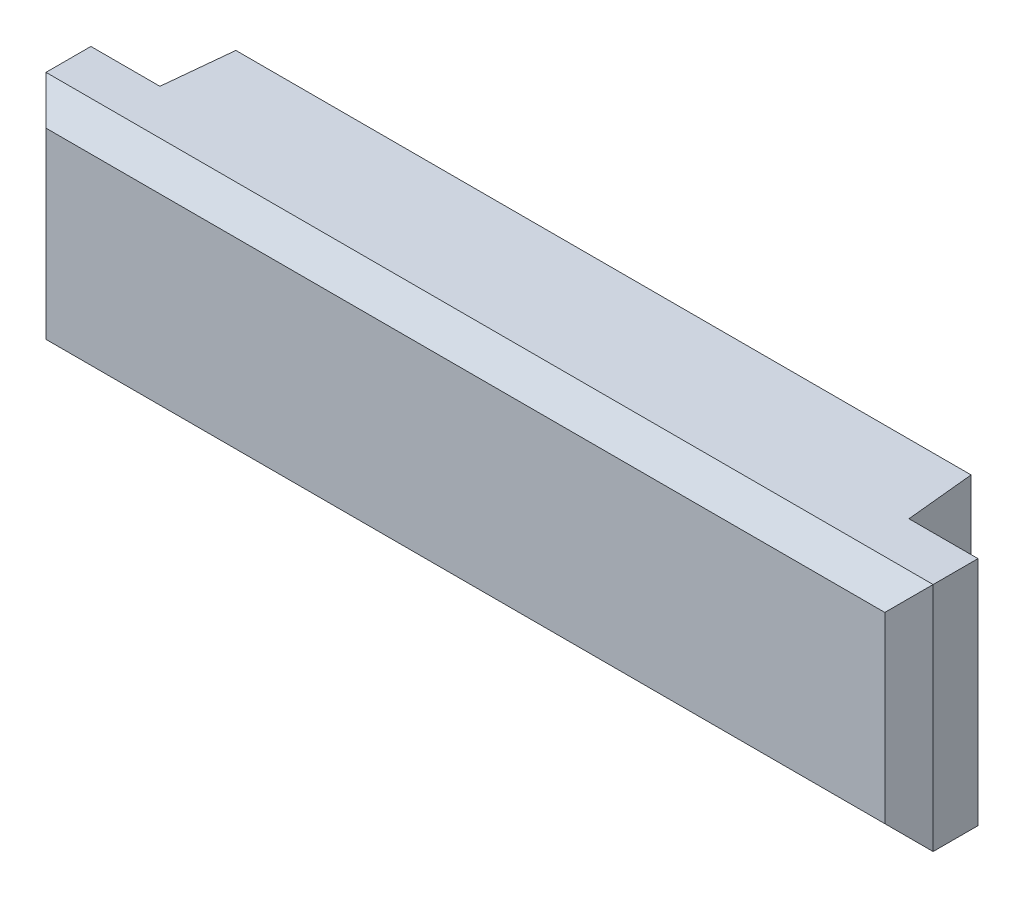
ISO-10303-21;
HEADER;
FILE_DESCRIPTION(('STEP AP214'),'2;1');
FILE_NAME('part.step','',(''),(''),'','','');
FILE_SCHEMA(('AUTOMOTIVE_DESIGN { 1 0 10303 214 1 1 1 1 }'));
ENDSEC;
DATA;
#1=APPLICATION_CONTEXT('core data for automotive mechanical design processes');
#2=APPLICATION_PROTOCOL_DEFINITION('international standard','automotive_design',2000,#1);
#3=PRODUCT_CONTEXT('',#1,'mechanical');
#4=PRODUCT('Part','Part','',(#3));
#5=PRODUCT_RELATED_PRODUCT_CATEGORY('part','',(#4));
#6=PRODUCT_DEFINITION_FORMATION('','',#4);
#7=PRODUCT_DEFINITION_CONTEXT('part definition',#1,'design');
#8=PRODUCT_DEFINITION('design','',#6,#7);
#9=PRODUCT_DEFINITION_SHAPE('','',#8);
#10=(LENGTH_UNIT() NAMED_UNIT(*) SI_UNIT(.MILLI.,.METRE.));
#11=(NAMED_UNIT(*) PLANE_ANGLE_UNIT() SI_UNIT($,.RADIAN.));
#12=(NAMED_UNIT(*) SI_UNIT($,.STERADIAN.) SOLID_ANGLE_UNIT());
#13=UNCERTAINTY_MEASURE_WITH_UNIT(LENGTH_MEASURE(1.E-05),#10,'distance_accuracy_value','');
#14=(GEOMETRIC_REPRESENTATION_CONTEXT(3) GLOBAL_UNCERTAINTY_ASSIGNED_CONTEXT((#13)) GLOBAL_UNIT_ASSIGNED_CONTEXT((#10,
#11,#12)) REPRESENTATION_CONTEXT('',''));
#15=CARTESIAN_POINT('',(0.,0.,0.));
#16=DIRECTION('',(0.,0.,1.));
#17=DIRECTION('',(1.,0.,0.));
#18=AXIS2_PLACEMENT_3D('',#15,#16,#17);
#19=CARTESIAN_POINT('',(0.,0.,0.));
#20=DIRECTION('',(0.,0.,1.));
#21=DIRECTION('',(1.,0.,0.));
#22=AXIS2_PLACEMENT_3D('',#19,#20,#21);
#23=PLANE('',#22);
#24=DIRECTION('',(0.,-1.,0.));
#25=VECTOR('',#24,1.);
#26=CARTESIAN_POINT('',(-10.65,-2.35,0.));
#27=LINE('',#26,#25);
#28=CARTESIAN_POINT('',(-10.65,2.35,0.));
#29=VERTEX_POINT('',#28);
#30=CARTESIAN_POINT('',(-10.65,-2.35,0.));
#31=VERTEX_POINT('',#30);
#32=EDGE_CURVE('E280',#29,#31,#27,.T.);
#33=ORIENTED_EDGE('',*,*,#32,.F.);
#34=DIRECTION('',(-1.,0.,0.));
#35=VECTOR('',#34,1.);
#36=CARTESIAN_POINT('',(10.65,2.35,0.));
#37=LINE('',#36,#35);
#38=CARTESIAN_POINT('',(10.65,2.35,0.));
#39=VERTEX_POINT('',#38);
#40=EDGE_CURVE('E272',#39,#29,#37,.T.);
#41=ORIENTED_EDGE('',*,*,#40,.F.);
#42=DIRECTION('',(0.,1.,0.));
#43=VECTOR('',#42,1.);
#44=CARTESIAN_POINT('',(10.65,-2.35,0.));
#45=LINE('',#44,#43);
#46=CARTESIAN_POINT('',(10.65,-2.35,0.));
#47=VERTEX_POINT('',#46);
#48=EDGE_CURVE('E279',#47,#39,#45,.T.);
#49=ORIENTED_EDGE('',*,*,#48,.F.);
#50=DIRECTION('',(1.,0.,0.));
#51=VECTOR('',#50,1.);
#52=CARTESIAN_POINT('',(10.65,-2.35,0.));
#53=LINE('',#52,#51);
#54=EDGE_CURVE('E196',#31,#47,#53,.T.);
#55=ORIENTED_EDGE('',*,*,#54,.F.);
#56=EDGE_LOOP('',(#33,#41,#49,#55));
#57=FACE_BOUND('',#56,.T.);
#58=ADVANCED_FACE('F53',(#57),#23,.F.);
#59=CARTESIAN_POINT('',(0.,2.35,0.));
#60=DIRECTION('',(0.,1.,0.));
#61=DIRECTION('',(0.,0.,1.));
#62=AXIS2_PLACEMENT_3D('',#59,#60,#61);
#63=PLANE('',#62);
#64=DIRECTION('',(0.,0.,-1.));
#65=VECTOR('',#64,1.);
#66=CARTESIAN_POINT('',(-12.85,2.35,4.));
#67=LINE('',#66,#65);
#68=CARTESIAN_POINT('',(-12.85,2.35,3.3));
#69=VERTEX_POINT('',#68);
#70=CARTESIAN_POINT('',(-12.85,2.35,2.));
#71=VERTEX_POINT('',#70);
#72=EDGE_CURVE('E153',#69,#71,#67,.T.);
#73=ORIENTED_EDGE('',*,*,#72,.F.);
#74=DIRECTION('',(1.,0.,0.));
#75=VECTOR('',#74,1.);
#76=CARTESIAN_POINT('',(0.,2.34999999999999,3.3));
#77=LINE('',#76,#75);
#78=CARTESIAN_POINT('',(12.85,2.35,3.3));
#79=VERTEX_POINT('',#78);
#80=EDGE_CURVE('E177',#69,#79,#77,.T.);
#81=ORIENTED_EDGE('',*,*,#80,.T.);
#82=DIRECTION('',(0.,0.,-1.));
#83=VECTOR('',#82,1.);
#84=CARTESIAN_POINT('',(12.85,2.35,4.));
#85=LINE('',#84,#83);
#86=CARTESIAN_POINT('',(12.85,2.35,2.));
#87=VERTEX_POINT('',#86);
#88=EDGE_CURVE('E171',#79,#87,#85,.T.);
#89=ORIENTED_EDGE('',*,*,#88,.T.);
#90=DIRECTION('',(-1.,0.,0.));
#91=VECTOR('',#90,1.);
#92=CARTESIAN_POINT('',(-12.85,2.35,2.));
#93=LINE('',#92,#91);
#94=CARTESIAN_POINT('',(10.85,2.35,2.));
#95=VERTEX_POINT('',#94);
#96=EDGE_CURVE('E168',#87,#95,#93,.T.);
#97=ORIENTED_EDGE('',*,*,#96,.T.);
#98=DIRECTION('',(-0.0995037190209992,0.,-0.995037190209989));
#99=VECTOR('',#98,1.);
#100=CARTESIAN_POINT('',(10.85,2.35,2.));
#101=LINE('',#100,#99);
#102=EDGE_CURVE('E310',#95,#39,#101,.T.);
#103=ORIENTED_EDGE('',*,*,#102,.T.);
#104=ORIENTED_EDGE('',*,*,#40,.T.);
#105=DIRECTION('',(0.0995037190209992,0.,-0.995037190209989));
#106=VECTOR('',#105,1.);
#107=CARTESIAN_POINT('',(-10.85,2.35,2.));
#108=LINE('',#107,#106);
#109=CARTESIAN_POINT('',(-10.85,2.35,2.));
#110=VERTEX_POINT('',#109);
#111=EDGE_CURVE('E299',#110,#29,#108,.T.);
#112=ORIENTED_EDGE('',*,*,#111,.F.);
#113=EDGE_CURVE('E160',#110,#71,#93,.T.);
#114=ORIENTED_EDGE('',*,*,#113,.T.);
#115=EDGE_LOOP('',(#73,#81,#89,#97,#103,#104,#112,#114));
#116=FACE_BOUND('',#115,.T.);
#117=ADVANCED_FACE('F174',(#116),#63,.T.);
#118=CARTESIAN_POINT('',(-10.5445544554455,0.,-1.05445544554456));
#119=DIRECTION('',(-0.995037190209989,0.,-0.0995037190209992));
#120=DIRECTION('',(-0.0995037190209992,0.,0.995037190209989));
#121=AXIS2_PLACEMENT_3D('',#118,#119,#120);
#122=PLANE('',#121);
#123=ORIENTED_EDGE('',*,*,#111,.T.);
#124=ORIENTED_EDGE('',*,*,#32,.T.);
#125=DIRECTION('',(0.0995037190209992,0.,-0.995037190209989));
#126=VECTOR('',#125,1.);
#127=CARTESIAN_POINT('',(-10.85,-2.35,2.));
#128=LINE('',#127,#126);
#129=CARTESIAN_POINT('',(-10.85,-2.35,2.));
#130=VERTEX_POINT('',#129);
#131=EDGE_CURVE('E297',#130,#31,#128,.T.);
#132=ORIENTED_EDGE('',*,*,#131,.F.);
#133=DIRECTION('',(0.,-1.,0.));
#134=VECTOR('',#133,1.);
#135=CARTESIAN_POINT('',(-10.85,-2.35,2.));
#136=LINE('',#135,#134);
#137=EDGE_CURVE('E185',#110,#130,#136,.T.);
#138=ORIENTED_EDGE('',*,*,#137,.F.);
#139=EDGE_LOOP('',(#123,#124,#132,#138));
#140=FACE_BOUND('',#139,.T.);
#141=ADVANCED_FACE('F241',(#140),#122,.T.);
#142=CARTESIAN_POINT('',(10.5445544554455,0.,-1.05445544554456));
#143=DIRECTION('',(0.995037190209989,0.,-0.0995037190209992));
#144=DIRECTION('',(-0.0995037190209992,0.,-0.995037190209989));
#145=AXIS2_PLACEMENT_3D('',#142,#143,#144);
#146=PLANE('',#145);
#147=DIRECTION('',(-0.0995037190209992,0.,-0.995037190209989));
#148=VECTOR('',#147,1.);
#149=CARTESIAN_POINT('',(10.85,-2.35,2.));
#150=LINE('',#149,#148);
#151=CARTESIAN_POINT('',(10.85,-2.35,2.));
#152=VERTEX_POINT('',#151);
#153=EDGE_CURVE('E302',#152,#47,#150,.T.);
#154=ORIENTED_EDGE('',*,*,#153,.T.);
#155=ORIENTED_EDGE('',*,*,#48,.T.);
#156=ORIENTED_EDGE('',*,*,#102,.F.);
#157=DIRECTION('',(0.,1.,0.));
#158=VECTOR('',#157,1.);
#159=CARTESIAN_POINT('',(10.85,-2.35,2.));
#160=LINE('',#159,#158);
#161=EDGE_CURVE('E138',#152,#95,#160,.T.);
#162=ORIENTED_EDGE('',*,*,#161,.F.);
#163=EDGE_LOOP('',(#154,#155,#156,#162));
#164=FACE_BOUND('',#163,.T.);
#165=ADVANCED_FACE('F333',(#164),#146,.T.);
#166=CARTESIAN_POINT('',(0.,-2.35,0.));
#167=DIRECTION('',(0.,-1.,0.));
#168=DIRECTION('',(0.,0.,-1.));
#169=AXIS2_PLACEMENT_3D('',#166,#167,#168);
#170=PLANE('',#169);
#171=ORIENTED_EDGE('',*,*,#131,.T.);
#172=ORIENTED_EDGE('',*,*,#54,.T.);
#173=ORIENTED_EDGE('',*,*,#153,.F.);
#174=DIRECTION('',(1.,0.,0.));
#175=VECTOR('',#174,1.);
#176=CARTESIAN_POINT('',(-10.85,-2.35,2.));
#177=LINE('',#176,#175);
#178=EDGE_CURVE('E183',#130,#152,#177,.T.);
#179=ORIENTED_EDGE('',*,*,#178,.F.);
#180=EDGE_LOOP('',(#171,#172,#173,#179));
#181=FACE_BOUND('',#180,.T.);
#182=ADVANCED_FACE('F247',(#181),#170,.T.);
#183=CARTESIAN_POINT('',(0.,0.,2.));
#184=DIRECTION('',(0.,0.,1.));
#185=DIRECTION('',(1.,0.,0.));
#186=AXIS2_PLACEMENT_3D('',#183,#184,#185);
#187=PLANE('',#186);
#188=ORIENTED_EDGE('',*,*,#178,.T.);
#189=ORIENTED_EDGE('',*,*,#161,.T.);
#190=ORIENTED_EDGE('',*,*,#96,.F.);
#191=DIRECTION('',(0.,1.,0.));
#192=VECTOR('',#191,1.);
#193=CARTESIAN_POINT('',(12.85,2.35,2.));
#194=LINE('',#193,#192);
#195=CARTESIAN_POINT('',(12.85,-4.35,2.));
#196=VERTEX_POINT('',#195);
#197=EDGE_CURVE('E149',#196,#87,#194,.T.);
#198=ORIENTED_EDGE('',*,*,#197,.F.);
#199=DIRECTION('',(1.,0.,0.));
#200=VECTOR('',#199,1.);
#201=CARTESIAN_POINT('',(-12.85,-4.35,2.));
#202=LINE('',#201,#200);
#203=CARTESIAN_POINT('',(-12.85,-4.35,2.));
#204=VERTEX_POINT('',#203);
#205=EDGE_CURVE('E133',#204,#196,#202,.T.);
#206=ORIENTED_EDGE('',*,*,#205,.F.);
#207=DIRECTION('',(0.,-1.,0.));
#208=VECTOR('',#207,1.);
#209=CARTESIAN_POINT('',(-12.85,2.35,2.));
#210=LINE('',#209,#208);
#211=EDGE_CURVE('E146',#71,#204,#210,.T.);
#212=ORIENTED_EDGE('',*,*,#211,.F.);
#213=ORIENTED_EDGE('',*,*,#113,.F.);
#214=ORIENTED_EDGE('',*,*,#137,.T.);
#215=EDGE_LOOP('',(#188,#189,#190,#198,#206,#212,#213,#214));
#216=FACE_BOUND('',#215,.T.);
#217=ADVANCED_FACE('F144',(#216),#187,.F.);
#218=CARTESIAN_POINT('',(-12.85,2.35,4.));
#219=DIRECTION('',(1.,0.,0.));
#220=DIRECTION('',(0.,0.,-1.));
#221=AXIS2_PLACEMENT_3D('',#218,#219,#220);
#222=PLANE('',#221);
#223=DIRECTION('',(0.,0.,-1.));
#224=VECTOR('',#223,1.);
#225=CARTESIAN_POINT('',(-12.85,-4.35,4.));
#226=LINE('',#225,#224);
#227=CARTESIAN_POINT('',(-12.85,-4.35,3.3));
#228=VERTEX_POINT('',#227);
#229=EDGE_CURVE('E130',#228,#204,#226,.T.);
#230=ORIENTED_EDGE('',*,*,#229,.F.);
#231=DIRECTION('',(0.,1.,0.));
#232=VECTOR('',#231,1.);
#233=CARTESIAN_POINT('',(-12.85,2.35,3.3));
#234=LINE('',#233,#232);
#235=EDGE_CURVE('E12',#228,#69,#234,.T.);
#236=ORIENTED_EDGE('',*,*,#235,.T.);
#237=ORIENTED_EDGE('',*,*,#72,.T.);
#238=ORIENTED_EDGE('',*,*,#211,.T.);
#239=EDGE_LOOP('',(#230,#236,#237,#238));
#240=FACE_BOUND('',#239,.T.);
#241=ADVANCED_FACE('F151',(#240),#222,.F.);
#242=CARTESIAN_POINT('',(-12.85,-4.35,4.));
#243=DIRECTION('',(0.,1.,0.));
#244=DIRECTION('',(0.,0.,1.));
#245=AXIS2_PLACEMENT_3D('',#242,#243,#244);
#246=PLANE('',#245);
#247=DIRECTION('',(0.,0.,-1.));
#248=VECTOR('',#247,1.);
#249=CARTESIAN_POINT('',(12.85,-4.35,4.));
#250=LINE('',#249,#248);
#251=CARTESIAN_POINT('',(12.85,-4.35,3.3));
#252=VERTEX_POINT('',#251);
#253=EDGE_CURVE('E139',#252,#196,#250,.T.);
#254=ORIENTED_EDGE('',*,*,#253,.F.);
#255=DIRECTION('',(-1.,0.,0.));
#256=VECTOR('',#255,1.);
#257=CARTESIAN_POINT('',(-12.85,-4.35,3.3));
#258=LINE('',#257,#256);
#259=EDGE_CURVE('E63',#252,#228,#258,.T.);
#260=ORIENTED_EDGE('',*,*,#259,.T.);
#261=ORIENTED_EDGE('',*,*,#229,.T.);
#262=ORIENTED_EDGE('',*,*,#205,.T.);
#263=EDGE_LOOP('',(#254,#260,#261,#262));
#264=FACE_BOUND('',#263,.T.);
#265=ADVANCED_FACE('F132',(#264),#246,.F.);
#266=CARTESIAN_POINT('',(12.85,2.35,4.));
#267=DIRECTION('',(-1.,0.,0.));
#268=DIRECTION('',(0.,0.,1.));
#269=AXIS2_PLACEMENT_3D('',#266,#267,#268);
#270=PLANE('',#269);
#271=ORIENTED_EDGE('',*,*,#88,.F.);
#272=DIRECTION('',(0.,-1.,0.));
#273=VECTOR('',#272,1.);
#274=CARTESIAN_POINT('',(12.85,-4.35,3.3));
#275=LINE('',#274,#273);
#276=EDGE_CURVE('E78',#79,#252,#275,.T.);
#277=ORIENTED_EDGE('',*,*,#276,.T.);
#278=ORIENTED_EDGE('',*,*,#253,.T.);
#279=ORIENTED_EDGE('',*,*,#197,.T.);
#280=EDGE_LOOP('',(#271,#277,#278,#279));
#281=FACE_BOUND('',#280,.T.);
#282=ADVANCED_FACE('F178',(#281),#270,.F.);
#283=CARTESIAN_POINT('',(0.,0.,4.));
#284=DIRECTION('',(0.,0.,1.));
#285=DIRECTION('',(1.,0.,0.));
#286=AXIS2_PLACEMENT_3D('',#283,#284,#285);
#287=PLANE('',#286);
#288=DIRECTION('',(0.,1.,0.));
#289=VECTOR('',#288,1.);
#290=CARTESIAN_POINT('',(12.15,2.35,4.));
#291=LINE('',#290,#289);
#292=CARTESIAN_POINT('',(12.15,-3.65,4.));
#293=VERTEX_POINT('',#292);
#294=CARTESIAN_POINT('',(12.15,1.65,4.));
#295=VERTEX_POINT('',#294);
#296=EDGE_CURVE('E198',#293,#295,#291,.T.);
#297=ORIENTED_EDGE('',*,*,#296,.T.);
#298=DIRECTION('',(-1.,0.,0.));
#299=VECTOR('',#298,1.);
#300=CARTESIAN_POINT('',(0.,1.64999999999999,4.));
#301=LINE('',#300,#299);
#302=CARTESIAN_POINT('',(-12.15,1.64999999999999,4.));
#303=VERTEX_POINT('',#302);
#304=EDGE_CURVE('E200',#295,#303,#301,.T.);
#305=ORIENTED_EDGE('',*,*,#304,.T.);
#306=DIRECTION('',(0.,-1.,0.));
#307=VECTOR('',#306,1.);
#308=CARTESIAN_POINT('',(-12.15,-4.35,4.));
#309=LINE('',#308,#307);
#310=CARTESIAN_POINT('',(-12.15,-3.65,4.));
#311=VERTEX_POINT('',#310);
#312=EDGE_CURVE('E193',#303,#311,#309,.T.);
#313=ORIENTED_EDGE('',*,*,#312,.T.);
#314=DIRECTION('',(1.,0.,0.));
#315=VECTOR('',#314,1.);
#316=CARTESIAN_POINT('',(12.85,-3.65,4.));
#317=LINE('',#316,#315);
#318=EDGE_CURVE('E195',#311,#293,#317,.T.);
#319=ORIENTED_EDGE('',*,*,#318,.T.);
#320=EDGE_LOOP('',(#297,#305,#313,#319));
#321=FACE_BOUND('',#320,.T.);
#322=ADVANCED_FACE('F220',(#321),#287,.T.);
#323=CARTESIAN_POINT('',(0.,-3.65,4.));
#324=DIRECTION('',(0.,-0.707106781186547,0.707106781186547));
#325=DIRECTION('',(-1.,0.,0.));
#326=AXIS2_PLACEMENT_3D('',#323,#324,#325);
#327=PLANE('',#326);
#328=DIRECTION('',(0.577350269189626,0.577350269189626,0.577350269189626));
#329=VECTOR('',#328,1.);
#330=CARTESIAN_POINT('',(-10.9333333333333,-2.43333333333333,5.21666666666667));
#331=LINE('',#330,#329);
#332=EDGE_CURVE('E157',#228,#311,#331,.T.);
#333=ORIENTED_EDGE('',*,*,#332,.F.);
#334=ORIENTED_EDGE('',*,*,#259,.F.);
#335=DIRECTION('',(-0.577350269189626,0.577350269189626,0.577350269189626));
#336=VECTOR('',#335,1.);
#337=CARTESIAN_POINT('',(8.1,0.400000000000002,8.05));
#338=LINE('',#337,#336);
#339=EDGE_CURVE('E58',#293,#252,#338,.F.);
#340=ORIENTED_EDGE('',*,*,#339,.F.);
#341=ORIENTED_EDGE('',*,*,#318,.F.);
#342=EDGE_LOOP('',(#333,#334,#340,#341));
#343=FACE_BOUND('',#342,.T.);
#344=ADVANCED_FACE('F56',(#343),#327,.T.);
#345=CARTESIAN_POINT('',(12.15,0.,4.));
#346=DIRECTION('',(0.707106781186547,0.,0.707106781186547));
#347=DIRECTION('',(0.,-1.,0.));
#348=AXIS2_PLACEMENT_3D('',#345,#346,#347);
#349=PLANE('',#348);
#350=ORIENTED_EDGE('',*,*,#339,.T.);
#351=ORIENTED_EDGE('',*,*,#276,.F.);
#352=DIRECTION('',(0.577350269189625,0.577350269189627,-0.577350269189625));
#353=VECTOR('',#352,1.);
#354=CARTESIAN_POINT('',(11.6,1.1,4.55));
#355=LINE('',#354,#353);
#356=EDGE_CURVE('E208',#295,#79,#355,.T.);
#357=ORIENTED_EDGE('',*,*,#356,.F.);
#358=ORIENTED_EDGE('',*,*,#296,.F.);
#359=EDGE_LOOP('',(#350,#351,#357,#358));
#360=FACE_BOUND('',#359,.T.);
#361=ADVANCED_FACE('F226',(#360),#349,.T.);
#362=CARTESIAN_POINT('',(-12.15,0.,4.));
#363=DIRECTION('',(-0.707106781186547,0.,0.707106781186547));
#364=DIRECTION('',(0.,1.,0.));
#365=AXIS2_PLACEMENT_3D('',#362,#363,#364);
#366=PLANE('',#365);
#367=ORIENTED_EDGE('',*,*,#332,.T.);
#368=ORIENTED_EDGE('',*,*,#312,.F.);
#369=DIRECTION('',(0.577350269189625,-0.577350269189626,0.577350269189625));
#370=VECTOR('',#369,1.);
#371=CARTESIAN_POINT('',(-11.6,1.09999999999999,4.55));
#372=LINE('',#371,#370);
#373=EDGE_CURVE('E206',#69,#303,#372,.T.);
#374=ORIENTED_EDGE('',*,*,#373,.F.);
#375=ORIENTED_EDGE('',*,*,#235,.F.);
#376=EDGE_LOOP('',(#367,#368,#374,#375));
#377=FACE_BOUND('',#376,.T.);
#378=ADVANCED_FACE('F213',(#377),#366,.T.);
#379=CARTESIAN_POINT('',(0.,1.64999999999999,4.));
#380=DIRECTION('',(0.,-0.707106781186547,-0.707106781186548));
#381=DIRECTION('',(-1.,0.,0.));
#382=AXIS2_PLACEMENT_3D('',#379,#380,#381);
#383=PLANE('',#382);
#384=ORIENTED_EDGE('',*,*,#356,.T.);
#385=ORIENTED_EDGE('',*,*,#80,.F.);
#386=ORIENTED_EDGE('',*,*,#373,.T.);
#387=ORIENTED_EDGE('',*,*,#304,.F.);
#388=EDGE_LOOP('',(#384,#385,#386,#387));
#389=FACE_BOUND('',#388,.T.);
#390=ADVANCED_FACE('F224',(#389),#383,.F.);
#391=CLOSED_SHELL('',(#58,#117,#141,#165,#182,#217,#241,#265,#282,#322,#344,#361,#378,#390));
#392=MANIFOLD_SOLID_BREP('B2',#391);
#393=ADVANCED_BREP_SHAPE_REPRESENTATION('',(#18,#392),#14);
#394=SHAPE_DEFINITION_REPRESENTATION(#9,#393);
ENDSEC;
END-ISO-10303-21;
